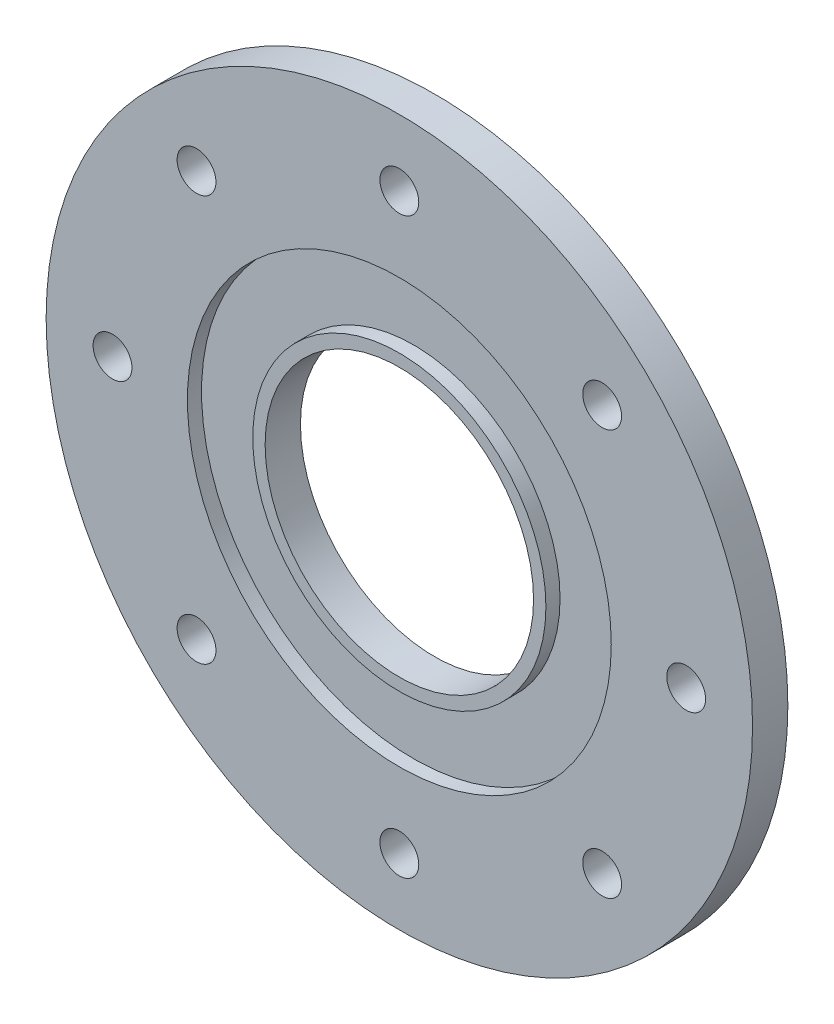
ISO-10303-21;
HEADER;
FILE_DESCRIPTION(('STEP AP214'),'2;1');
FILE_NAME('part.step','',(''),(''),'','','');
FILE_SCHEMA(('AUTOMOTIVE_DESIGN { 1 0 10303 214 1 1 1 1 }'));
ENDSEC;
DATA;
#1=APPLICATION_CONTEXT('core data for automotive mechanical design processes');
#2=APPLICATION_PROTOCOL_DEFINITION('international standard','automotive_design',2000,#1);
#3=PRODUCT_CONTEXT('',#1,'mechanical');
#4=PRODUCT('Part','Part','',(#3));
#5=PRODUCT_RELATED_PRODUCT_CATEGORY('part','',(#4));
#6=PRODUCT_DEFINITION_FORMATION('','',#4);
#7=PRODUCT_DEFINITION_CONTEXT('part definition',#1,'design');
#8=PRODUCT_DEFINITION('design','',#6,#7);
#9=PRODUCT_DEFINITION_SHAPE('','',#8);
#10=(LENGTH_UNIT() NAMED_UNIT(*) SI_UNIT(.MILLI.,.METRE.));
#11=(NAMED_UNIT(*) PLANE_ANGLE_UNIT() SI_UNIT($,.RADIAN.));
#12=(NAMED_UNIT(*) SI_UNIT($,.STERADIAN.) SOLID_ANGLE_UNIT());
#13=UNCERTAINTY_MEASURE_WITH_UNIT(LENGTH_MEASURE(1.E-05),#10,'distance_accuracy_value','');
#14=(GEOMETRIC_REPRESENTATION_CONTEXT(3) GLOBAL_UNCERTAINTY_ASSIGNED_CONTEXT((#13)) GLOBAL_UNIT_ASSIGNED_CONTEXT((#10,
#11,#12)) REPRESENTATION_CONTEXT('',''));
#15=CARTESIAN_POINT('',(0.,0.,0.));
#16=DIRECTION('',(0.,0.,1.));
#17=DIRECTION('',(1.,0.,0.));
#18=AXIS2_PLACEMENT_3D('',#15,#16,#17);
#19=CARTESIAN_POINT('',(0.,0.,5.));
#20=DIRECTION('',(0.,0.,1.));
#21=DIRECTION('',(1.,0.,0.));
#22=AXIS2_PLACEMENT_3D('',#19,#20,#21);
#23=PLANE('',#22);
#24=CARTESIAN_POINT('',(0.,0.,5.));
#25=DIRECTION('',(0.,0.,1.));
#26=DIRECTION('',(1.,0.,0.));
#27=AXIS2_PLACEMENT_3D('',#24,#25,#26);
#28=CIRCLE('',#27,19.);
#29=CARTESIAN_POINT('',(19.,0.,5.));
#30=VERTEX_POINT('',#29);
#31=EDGE_CURVE('E44',#30,#30,#28,.T.);
#32=ORIENTED_EDGE('',*,*,#31,.F.);
#33=EDGE_LOOP('',(#32));
#34=FACE_BOUND('',#33,.T.);
#35=CARTESIAN_POINT('',(0.,0.,5.));
#36=DIRECTION('',(0.,0.,1.));
#37=DIRECTION('',(1.,0.,0.));
#38=AXIS2_PLACEMENT_3D('',#35,#36,#37);
#39=CIRCLE('',#38,20.75);
#40=CARTESIAN_POINT('',(20.75,0.,5.));
#41=VERTEX_POINT('',#40);
#42=EDGE_CURVE('E58',#41,#41,#39,.T.);
#43=ORIENTED_EDGE('',*,*,#42,.T.);
#44=EDGE_LOOP('',(#43));
#45=FACE_BOUND('',#44,.T.);
#46=ADVANCED_FACE('F33',(#34,#45),#23,.T.);
#47=CARTESIAN_POINT('',(28.7106551721743,-28.7106551721744,5.));
#48=DIRECTION('',(0.,0.,1.));
#49=DIRECTION('',(1.,0.,0.));
#50=AXIS2_PLACEMENT_3D('',#47,#48,#49);
#51=CIRCLE('',#50,2.75);
#52=CARTESIAN_POINT('',(31.4606551721743,-28.7106551721744,5.));
#53=VERTEX_POINT('',#52);
#54=EDGE_CURVE('E105',#53,#53,#51,.T.);
#55=ORIENTED_EDGE('',*,*,#54,.F.);
#56=EDGE_LOOP('',(#55));
#57=FACE_BOUND('',#56,.T.);
#58=CARTESIAN_POINT('',(-1.41764609570561E-13,-40.6029979291063,5.));
#59=DIRECTION('',(0.,0.,1.));
#60=DIRECTION('',(1.,0.,0.));
#61=AXIS2_PLACEMENT_3D('',#58,#59,#60);
#62=CIRCLE('',#61,2.75);
#63=CARTESIAN_POINT('',(2.74999999999986,-40.6029979291063,5.));
#64=VERTEX_POINT('',#63);
#65=EDGE_CURVE('E99',#64,#64,#62,.T.);
#66=ORIENTED_EDGE('',*,*,#65,.F.);
#67=EDGE_LOOP('',(#66));
#68=FACE_BOUND('',#67,.T.);
#69=CARTESIAN_POINT('',(-28.7106551721745,-28.7106551721742,5.));
#70=DIRECTION('',(0.,0.,1.));
#71=DIRECTION('',(1.,0.,0.));
#72=AXIS2_PLACEMENT_3D('',#69,#70,#71);
#73=CIRCLE('',#72,2.75);
#74=CARTESIAN_POINT('',(-25.9606551721745,-28.7106551721742,5.));
#75=VERTEX_POINT('',#74);
#76=EDGE_CURVE('E93',#75,#75,#73,.T.);
#77=ORIENTED_EDGE('',*,*,#76,.F.);
#78=EDGE_LOOP('',(#77));
#79=FACE_BOUND('',#78,.T.);
#80=CARTESIAN_POINT('',(-40.6029979291063,2.83529219141122E-13,5.));
#81=DIRECTION('',(0.,0.,1.));
#82=DIRECTION('',(1.,0.,0.));
#83=AXIS2_PLACEMENT_3D('',#80,#81,#82);
#84=CIRCLE('',#83,2.75);
#85=CARTESIAN_POINT('',(-37.8529979291063,2.83529219141122E-13,5.));
#86=VERTEX_POINT('',#85);
#87=EDGE_CURVE('E87',#86,#86,#84,.T.);
#88=ORIENTED_EDGE('',*,*,#87,.F.);
#89=EDGE_LOOP('',(#88));
#90=FACE_BOUND('',#89,.T.);
#91=CARTESIAN_POINT('',(-28.7106551721741,28.7106551721746,5.));
#92=DIRECTION('',(0.,0.,1.));
#93=DIRECTION('',(1.,0.,0.));
#94=AXIS2_PLACEMENT_3D('',#91,#92,#93);
#95=CIRCLE('',#94,2.75);
#96=CARTESIAN_POINT('',(-25.9606551721741,28.7106551721746,5.));
#97=VERTEX_POINT('',#96);
#98=EDGE_CURVE('E81',#97,#97,#95,.T.);
#99=ORIENTED_EDGE('',*,*,#98,.F.);
#100=EDGE_LOOP('',(#99));
#101=FACE_BOUND('',#100,.T.);
#102=CARTESIAN_POINT('',(4.25293828711683E-13,40.6029979291063,5.));
#103=DIRECTION('',(0.,0.,1.));
#104=DIRECTION('',(1.,0.,0.));
#105=AXIS2_PLACEMENT_3D('',#102,#103,#104);
#106=CIRCLE('',#105,2.75);
#107=CARTESIAN_POINT('',(2.75000000000043,40.6029979291063,5.));
#108=VERTEX_POINT('',#107);
#109=EDGE_CURVE('E75',#108,#108,#106,.T.);
#110=ORIENTED_EDGE('',*,*,#109,.F.);
#111=EDGE_LOOP('',(#110));
#112=FACE_BOUND('',#111,.T.);
#113=CARTESIAN_POINT('',(28.7106551721747,28.710655172174,5.));
#114=DIRECTION('',(0.,0.,1.));
#115=DIRECTION('',(1.,0.,0.));
#116=AXIS2_PLACEMENT_3D('',#113,#114,#115);
#117=CIRCLE('',#116,2.75);
#118=CARTESIAN_POINT('',(31.4606551721747,28.710655172174,5.));
#119=VERTEX_POINT('',#118);
#120=EDGE_CURVE('E69',#119,#119,#117,.T.);
#121=ORIENTED_EDGE('',*,*,#120,.F.);
#122=EDGE_LOOP('',(#121));
#123=FACE_BOUND('',#122,.T.);
#124=CARTESIAN_POINT('',(40.6029979291063,0.,5.));
#125=DIRECTION('',(0.,0.,1.));
#126=DIRECTION('',(1.,0.,0.));
#127=AXIS2_PLACEMENT_3D('',#124,#125,#126);
#128=CIRCLE('',#127,2.75);
#129=CARTESIAN_POINT('',(43.3529979291063,0.,5.));
#130=VERTEX_POINT('',#129);
#131=EDGE_CURVE('E66',#130,#130,#128,.T.);
#132=ORIENTED_EDGE('',*,*,#131,.F.);
#133=EDGE_LOOP('',(#132));
#134=FACE_BOUND('',#133,.T.);
#135=CARTESIAN_POINT('',(0.,0.,5.));
#136=DIRECTION('',(0.,0.,1.));
#137=DIRECTION('',(1.,0.,0.));
#138=AXIS2_PLACEMENT_3D('',#135,#136,#137);
#139=CIRCLE('',#138,30.);
#140=CARTESIAN_POINT('',(30.,0.,5.));
#141=VERTEX_POINT('',#140);
#142=EDGE_CURVE('E52',#141,#141,#139,.T.);
#143=ORIENTED_EDGE('',*,*,#142,.F.);
#144=EDGE_LOOP('',(#143));
#145=FACE_BOUND('',#144,.T.);
#146=CARTESIAN_POINT('',(0.,0.,5.));
#147=DIRECTION('',(0.,0.,1.));
#148=DIRECTION('',(1.,0.,0.));
#149=AXIS2_PLACEMENT_3D('',#146,#147,#148);
#150=CIRCLE('',#149,50.);
#151=CARTESIAN_POINT('',(50.,0.,5.));
#152=VERTEX_POINT('',#151);
#153=EDGE_CURVE('E10',#152,#152,#150,.T.);
#154=ORIENTED_EDGE('',*,*,#153,.T.);
#155=EDGE_LOOP('',(#154));
#156=FACE_BOUND('',#155,.T.);
#157=ADVANCED_FACE('F118',(#57,#68,#79,#90,#101,#112,#123,#134,#145,#156),#23,.T.);
#158=CARTESIAN_POINT('',(0.,0.,0.));
#159=DIRECTION('',(0.,0.,1.));
#160=DIRECTION('',(1.,0.,0.));
#161=AXIS2_PLACEMENT_3D('',#158,#159,#160);
#162=PLANE('',#161);
#163=CARTESIAN_POINT('',(28.7106551721743,-28.7106551721744,0.));
#164=DIRECTION('',(0.,0.,1.));
#165=DIRECTION('',(1.,0.,0.));
#166=AXIS2_PLACEMENT_3D('',#163,#164,#165);
#167=CIRCLE('',#166,2.75);
#168=CARTESIAN_POINT('',(31.4606551721743,-28.7106551721744,0.));
#169=VERTEX_POINT('',#168);
#170=EDGE_CURVE('E108',#169,#169,#167,.F.);
#171=ORIENTED_EDGE('',*,*,#170,.F.);
#172=EDGE_LOOP('',(#171));
#173=FACE_BOUND('',#172,.T.);
#174=CARTESIAN_POINT('',(-1.41764609570561E-13,-40.6029979291063,0.));
#175=DIRECTION('',(0.,0.,1.));
#176=DIRECTION('',(1.,0.,0.));
#177=AXIS2_PLACEMENT_3D('',#174,#175,#176);
#178=CIRCLE('',#177,2.75);
#179=CARTESIAN_POINT('',(2.74999999999986,-40.6029979291063,0.));
#180=VERTEX_POINT('',#179);
#181=EDGE_CURVE('E102',#180,#180,#178,.F.);
#182=ORIENTED_EDGE('',*,*,#181,.F.);
#183=EDGE_LOOP('',(#182));
#184=FACE_BOUND('',#183,.T.);
#185=CARTESIAN_POINT('',(-28.7106551721745,-28.7106551721742,0.));
#186=DIRECTION('',(0.,0.,1.));
#187=DIRECTION('',(1.,0.,0.));
#188=AXIS2_PLACEMENT_3D('',#185,#186,#187);
#189=CIRCLE('',#188,2.75);
#190=CARTESIAN_POINT('',(-25.9606551721745,-28.7106551721742,0.));
#191=VERTEX_POINT('',#190);
#192=EDGE_CURVE('E96',#191,#191,#189,.F.);
#193=ORIENTED_EDGE('',*,*,#192,.F.);
#194=EDGE_LOOP('',(#193));
#195=FACE_BOUND('',#194,.T.);
#196=CARTESIAN_POINT('',(-40.6029979291063,2.83529219141122E-13,0.));
#197=DIRECTION('',(0.,0.,1.));
#198=DIRECTION('',(1.,0.,0.));
#199=AXIS2_PLACEMENT_3D('',#196,#197,#198);
#200=CIRCLE('',#199,2.75);
#201=CARTESIAN_POINT('',(-37.8529979291063,2.83529219141122E-13,0.));
#202=VERTEX_POINT('',#201);
#203=EDGE_CURVE('E90',#202,#202,#200,.F.);
#204=ORIENTED_EDGE('',*,*,#203,.F.);
#205=EDGE_LOOP('',(#204));
#206=FACE_BOUND('',#205,.T.);
#207=CARTESIAN_POINT('',(-28.7106551721741,28.7106551721746,0.));
#208=DIRECTION('',(0.,0.,1.));
#209=DIRECTION('',(1.,0.,0.));
#210=AXIS2_PLACEMENT_3D('',#207,#208,#209);
#211=CIRCLE('',#210,2.75);
#212=CARTESIAN_POINT('',(-25.9606551721741,28.7106551721746,0.));
#213=VERTEX_POINT('',#212);
#214=EDGE_CURVE('E84',#213,#213,#211,.F.);
#215=ORIENTED_EDGE('',*,*,#214,.F.);
#216=EDGE_LOOP('',(#215));
#217=FACE_BOUND('',#216,.T.);
#218=CARTESIAN_POINT('',(4.25293828711683E-13,40.6029979291063,0.));
#219=DIRECTION('',(0.,0.,1.));
#220=DIRECTION('',(1.,0.,0.));
#221=AXIS2_PLACEMENT_3D('',#218,#219,#220);
#222=CIRCLE('',#221,2.75);
#223=CARTESIAN_POINT('',(2.75000000000043,40.6029979291063,0.));
#224=VERTEX_POINT('',#223);
#225=EDGE_CURVE('E78',#224,#224,#222,.F.);
#226=ORIENTED_EDGE('',*,*,#225,.F.);
#227=EDGE_LOOP('',(#226));
#228=FACE_BOUND('',#227,.T.);
#229=CARTESIAN_POINT('',(28.7106551721747,28.710655172174,0.));
#230=DIRECTION('',(0.,0.,1.));
#231=DIRECTION('',(1.,0.,0.));
#232=AXIS2_PLACEMENT_3D('',#229,#230,#231);
#233=CIRCLE('',#232,2.75);
#234=CARTESIAN_POINT('',(31.4606551721747,28.710655172174,0.));
#235=VERTEX_POINT('',#234);
#236=EDGE_CURVE('E72',#235,#235,#233,.F.);
#237=ORIENTED_EDGE('',*,*,#236,.F.);
#238=EDGE_LOOP('',(#237));
#239=FACE_BOUND('',#238,.T.);
#240=CARTESIAN_POINT('',(40.6029979291063,0.,0.));
#241=DIRECTION('',(0.,0.,1.));
#242=DIRECTION('',(1.,0.,0.));
#243=AXIS2_PLACEMENT_3D('',#240,#241,#242);
#244=CIRCLE('',#243,2.75);
#245=CARTESIAN_POINT('',(43.3529979291063,0.,0.));
#246=VERTEX_POINT('',#245);
#247=EDGE_CURVE('E61',#246,#246,#244,.F.);
#248=ORIENTED_EDGE('',*,*,#247,.F.);
#249=EDGE_LOOP('',(#248));
#250=FACE_BOUND('',#249,.T.);
#251=CARTESIAN_POINT('',(0.,0.,0.));
#252=DIRECTION('',(0.,0.,1.));
#253=DIRECTION('',(1.,0.,0.));
#254=AXIS2_PLACEMENT_3D('',#251,#252,#253);
#255=CIRCLE('',#254,50.);
#256=CARTESIAN_POINT('',(50.,0.,0.));
#257=VERTEX_POINT('',#256);
#258=EDGE_CURVE('E37',#257,#257,#255,.T.);
#259=ORIENTED_EDGE('',*,*,#258,.F.);
#260=EDGE_LOOP('',(#259));
#261=FACE_BOUND('',#260,.T.);
#262=CARTESIAN_POINT('',(0.,0.,0.));
#263=DIRECTION('',(0.,0.,1.));
#264=DIRECTION('',(1.,0.,0.));
#265=AXIS2_PLACEMENT_3D('',#262,#263,#264);
#266=CIRCLE('',#265,19.);
#267=CARTESIAN_POINT('',(19.,0.,0.));
#268=VERTEX_POINT('',#267);
#269=EDGE_CURVE('E46',#268,#268,#266,.T.);
#270=ORIENTED_EDGE('',*,*,#269,.T.);
#271=EDGE_LOOP('',(#270));
#272=FACE_BOUND('',#271,.T.);
#273=ADVANCED_FACE('F115',(#173,#184,#195,#206,#217,#228,#239,#250,#261,#272),#162,.F.);
#274=CARTESIAN_POINT('',(0.,0.,5.));
#275=DIRECTION('',(0.,0.,-1.));
#276=DIRECTION('',(-1.,0.,0.));
#277=AXIS2_PLACEMENT_3D('',#274,#275,#276);
#278=CYLINDRICAL_SURFACE('',#277,50.);
#279=ORIENTED_EDGE('',*,*,#153,.F.);
#280=EDGE_LOOP('',(#279));
#281=FACE_BOUND('',#280,.T.);
#282=ORIENTED_EDGE('',*,*,#258,.T.);
#283=EDGE_LOOP('',(#282));
#284=FACE_BOUND('',#283,.T.);
#285=ADVANCED_FACE('F35',(#281,#284),#278,.T.);
#286=CARTESIAN_POINT('',(0.,0.,5.));
#287=DIRECTION('',(0.,0.,-1.));
#288=DIRECTION('',(-1.,0.,0.));
#289=AXIS2_PLACEMENT_3D('',#286,#287,#288);
#290=CYLINDRICAL_SURFACE('',#289,19.);
#291=ORIENTED_EDGE('',*,*,#31,.T.);
#292=EDGE_LOOP('',(#291));
#293=FACE_BOUND('',#292,.T.);
#294=ORIENTED_EDGE('',*,*,#269,.F.);
#295=EDGE_LOOP('',(#294));
#296=FACE_BOUND('',#295,.T.);
#297=ADVANCED_FACE('F137',(#293,#296),#290,.F.);
#298=CARTESIAN_POINT('',(0.,0.,3.));
#299=DIRECTION('',(0.,0.,1.));
#300=DIRECTION('',(1.,0.,0.));
#301=AXIS2_PLACEMENT_3D('',#298,#299,#300);
#302=CYLINDRICAL_SURFACE('',#301,30.);
#303=CARTESIAN_POINT('',(0.,0.,3.));
#304=DIRECTION('',(0.,0.,1.));
#305=DIRECTION('',(1.,0.,0.));
#306=AXIS2_PLACEMENT_3D('',#303,#304,#305);
#307=CIRCLE('',#306,30.);
#308=CARTESIAN_POINT('',(30.,0.,3.));
#309=VERTEX_POINT('',#308);
#310=EDGE_CURVE('E49',#309,#309,#307,.T.);
#311=ORIENTED_EDGE('',*,*,#310,.F.);
#312=EDGE_LOOP('',(#311));
#313=FACE_BOUND('',#312,.T.);
#314=ORIENTED_EDGE('',*,*,#142,.T.);
#315=EDGE_LOOP('',(#314));
#316=FACE_BOUND('',#315,.T.);
#317=ADVANCED_FACE('F139',(#313,#316),#302,.F.);
#318=CARTESIAN_POINT('',(0.,0.,3.));
#319=DIRECTION('',(0.,0.,1.));
#320=DIRECTION('',(1.,0.,0.));
#321=AXIS2_PLACEMENT_3D('',#318,#319,#320);
#322=PLANE('',#321);
#323=CARTESIAN_POINT('',(0.,0.,3.));
#324=DIRECTION('',(0.,0.,1.));
#325=DIRECTION('',(1.,0.,0.));
#326=AXIS2_PLACEMENT_3D('',#323,#324,#325);
#327=CIRCLE('',#326,20.75);
#328=CARTESIAN_POINT('',(20.75,0.,3.));
#329=VERTEX_POINT('',#328);
#330=EDGE_CURVE('E55',#329,#329,#327,.T.);
#331=ORIENTED_EDGE('',*,*,#330,.F.);
#332=EDGE_LOOP('',(#331));
#333=FACE_BOUND('',#332,.T.);
#334=ORIENTED_EDGE('',*,*,#310,.T.);
#335=EDGE_LOOP('',(#334));
#336=FACE_BOUND('',#335,.T.);
#337=ADVANCED_FACE('F146',(#333,#336),#322,.T.);
#338=CARTESIAN_POINT('',(0.,0.,3.));
#339=DIRECTION('',(0.,0.,1.));
#340=DIRECTION('',(1.,0.,0.));
#341=AXIS2_PLACEMENT_3D('',#338,#339,#340);
#342=CYLINDRICAL_SURFACE('',#341,20.75);
#343=ORIENTED_EDGE('',*,*,#330,.T.);
#344=EDGE_LOOP('',(#343));
#345=FACE_BOUND('',#344,.T.);
#346=ORIENTED_EDGE('',*,*,#42,.F.);
#347=EDGE_LOOP('',(#346));
#348=FACE_BOUND('',#347,.T.);
#349=ADVANCED_FACE('F161',(#345,#348),#342,.T.);
#350=CARTESIAN_POINT('',(40.6029979291063,0.,-7.77817459305203));
#351=DIRECTION('',(0.,0.,1.));
#352=DIRECTION('',(1.,0.,0.));
#353=AXIS2_PLACEMENT_3D('',#350,#351,#352);
#354=CYLINDRICAL_SURFACE('',#353,2.75);
#355=ORIENTED_EDGE('',*,*,#247,.T.);
#356=EDGE_LOOP('',(#355));
#357=FACE_BOUND('',#356,.T.);
#358=ORIENTED_EDGE('',*,*,#131,.T.);
#359=EDGE_LOOP('',(#358));
#360=FACE_BOUND('',#359,.T.);
#361=ADVANCED_FACE('F163',(#357,#360),#354,.F.);
#362=CARTESIAN_POINT('',(28.7106551721747,28.710655172174,-7.77817459305203));
#363=DIRECTION('',(0.,0.,1.));
#364=DIRECTION('',(1.,0.,0.));
#365=AXIS2_PLACEMENT_3D('',#362,#363,#364);
#366=CYLINDRICAL_SURFACE('',#365,2.75);
#367=ORIENTED_EDGE('',*,*,#236,.T.);
#368=EDGE_LOOP('',(#367));
#369=FACE_BOUND('',#368,.T.);
#370=ORIENTED_EDGE('',*,*,#120,.T.);
#371=EDGE_LOOP('',(#370));
#372=FACE_BOUND('',#371,.T.);
#373=ADVANCED_FACE('F170',(#369,#372),#366,.F.);
#374=CARTESIAN_POINT('',(4.25293828711683E-13,40.6029979291063,-7.77817459305203));
#375=DIRECTION('',(0.,0.,1.));
#376=DIRECTION('',(1.,0.,0.));
#377=AXIS2_PLACEMENT_3D('',#374,#375,#376);
#378=CYLINDRICAL_SURFACE('',#377,2.75);
#379=ORIENTED_EDGE('',*,*,#225,.T.);
#380=EDGE_LOOP('',(#379));
#381=FACE_BOUND('',#380,.T.);
#382=ORIENTED_EDGE('',*,*,#109,.T.);
#383=EDGE_LOOP('',(#382));
#384=FACE_BOUND('',#383,.T.);
#385=ADVANCED_FACE('F178',(#381,#384),#378,.F.);
#386=CARTESIAN_POINT('',(-28.7106551721741,28.7106551721746,-7.77817459305203));
#387=DIRECTION('',(0.,0.,1.));
#388=DIRECTION('',(1.,0.,0.));
#389=AXIS2_PLACEMENT_3D('',#386,#387,#388);
#390=CYLINDRICAL_SURFACE('',#389,2.75);
#391=ORIENTED_EDGE('',*,*,#214,.T.);
#392=EDGE_LOOP('',(#391));
#393=FACE_BOUND('',#392,.T.);
#394=ORIENTED_EDGE('',*,*,#98,.T.);
#395=EDGE_LOOP('',(#394));
#396=FACE_BOUND('',#395,.T.);
#397=ADVANCED_FACE('F182',(#393,#396),#390,.F.);
#398=CARTESIAN_POINT('',(-40.6029979291063,2.83529219141122E-13,-7.77817459305203));
#399=DIRECTION('',(0.,0.,1.));
#400=DIRECTION('',(1.,0.,0.));
#401=AXIS2_PLACEMENT_3D('',#398,#399,#400);
#402=CYLINDRICAL_SURFACE('',#401,2.75);
#403=ORIENTED_EDGE('',*,*,#203,.T.);
#404=EDGE_LOOP('',(#403));
#405=FACE_BOUND('',#404,.T.);
#406=ORIENTED_EDGE('',*,*,#87,.T.);
#407=EDGE_LOOP('',(#406));
#408=FACE_BOUND('',#407,.T.);
#409=ADVANCED_FACE('F186',(#405,#408),#402,.F.);
#410=CARTESIAN_POINT('',(-28.7106551721745,-28.7106551721742,-7.77817459305203));
#411=DIRECTION('',(0.,0.,1.));
#412=DIRECTION('',(1.,0.,0.));
#413=AXIS2_PLACEMENT_3D('',#410,#411,#412);
#414=CYLINDRICAL_SURFACE('',#413,2.75);
#415=ORIENTED_EDGE('',*,*,#192,.T.);
#416=EDGE_LOOP('',(#415));
#417=FACE_BOUND('',#416,.T.);
#418=ORIENTED_EDGE('',*,*,#76,.T.);
#419=EDGE_LOOP('',(#418));
#420=FACE_BOUND('',#419,.T.);
#421=ADVANCED_FACE('F190',(#417,#420),#414,.F.);
#422=CARTESIAN_POINT('',(-1.41764609570561E-13,-40.6029979291063,-7.77817459305203));
#423=DIRECTION('',(0.,0.,1.));
#424=DIRECTION('',(1.,0.,0.));
#425=AXIS2_PLACEMENT_3D('',#422,#423,#424);
#426=CYLINDRICAL_SURFACE('',#425,2.75);
#427=ORIENTED_EDGE('',*,*,#181,.T.);
#428=EDGE_LOOP('',(#427));
#429=FACE_BOUND('',#428,.T.);
#430=ORIENTED_EDGE('',*,*,#65,.T.);
#431=EDGE_LOOP('',(#430));
#432=FACE_BOUND('',#431,.T.);
#433=ADVANCED_FACE('F194',(#429,#432),#426,.F.);
#434=CARTESIAN_POINT('',(28.7106551721743,-28.7106551721744,-7.77817459305203));
#435=DIRECTION('',(0.,0.,1.));
#436=DIRECTION('',(1.,0.,0.));
#437=AXIS2_PLACEMENT_3D('',#434,#435,#436);
#438=CYLINDRICAL_SURFACE('',#437,2.75);
#439=ORIENTED_EDGE('',*,*,#170,.T.);
#440=EDGE_LOOP('',(#439));
#441=FACE_BOUND('',#440,.T.);
#442=ORIENTED_EDGE('',*,*,#54,.T.);
#443=EDGE_LOOP('',(#442));
#444=FACE_BOUND('',#443,.T.);
#445=ADVANCED_FACE('F112',(#441,#444),#438,.F.);
#446=CLOSED_SHELL('',(#46,#157,#273,#285,#297,#317,#337,#349,#361,#373,#385,#397,#409,#421,#433,#445));
#447=MANIFOLD_SOLID_BREP('B2',#446);
#448=ADVANCED_BREP_SHAPE_REPRESENTATION('',(#18,#447),#14);
#449=SHAPE_DEFINITION_REPRESENTATION(#9,#448);
ENDSEC;
END-ISO-10303-21;
